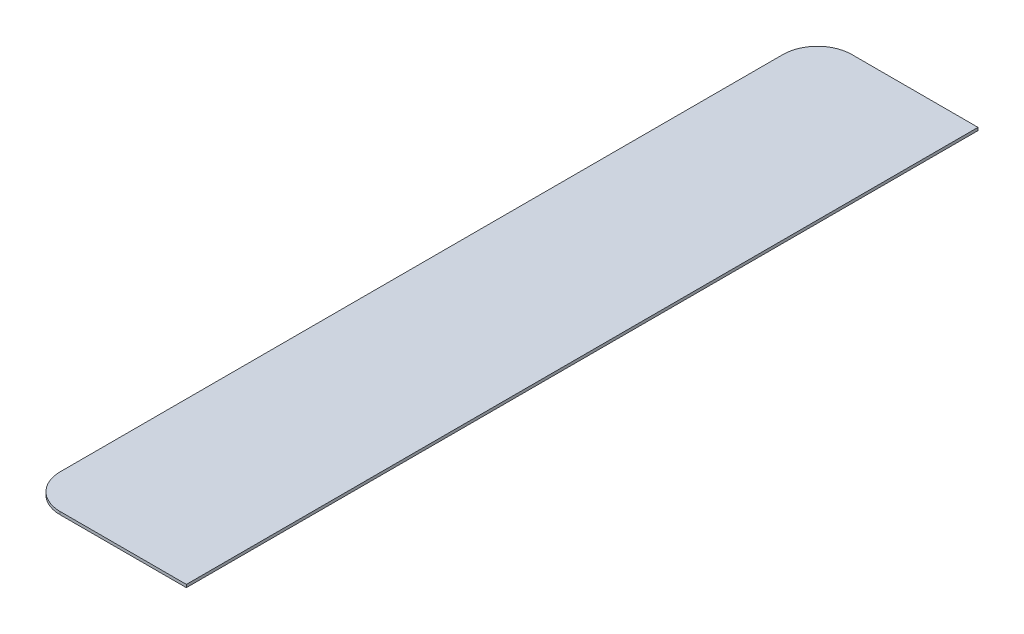
ISO-10303-21;
HEADER;
FILE_DESCRIPTION(('STEP AP214'),'2;1');
FILE_NAME('part.step','',(''),(''),'','','');
FILE_SCHEMA(('AUTOMOTIVE_DESIGN { 1 0 10303 214 1 1 1 1 }'));
ENDSEC;
DATA;
#1=APPLICATION_CONTEXT('core data for automotive mechanical design processes');
#2=APPLICATION_PROTOCOL_DEFINITION('international standard','automotive_design',2000,#1);
#3=PRODUCT_CONTEXT('',#1,'mechanical');
#4=PRODUCT('Part','Part','',(#3));
#5=PRODUCT_RELATED_PRODUCT_CATEGORY('part','',(#4));
#6=PRODUCT_DEFINITION_FORMATION('','',#4);
#7=PRODUCT_DEFINITION_CONTEXT('part definition',#1,'design');
#8=PRODUCT_DEFINITION('design','',#6,#7);
#9=PRODUCT_DEFINITION_SHAPE('','',#8);
#10=(LENGTH_UNIT() NAMED_UNIT(*) SI_UNIT(.MILLI.,.METRE.));
#11=(NAMED_UNIT(*) PLANE_ANGLE_UNIT() SI_UNIT($,.RADIAN.));
#12=(NAMED_UNIT(*) SI_UNIT($,.STERADIAN.) SOLID_ANGLE_UNIT());
#13=UNCERTAINTY_MEASURE_WITH_UNIT(LENGTH_MEASURE(1.E-05),#10,'distance_accuracy_value','');
#14=(GEOMETRIC_REPRESENTATION_CONTEXT(3) GLOBAL_UNCERTAINTY_ASSIGNED_CONTEXT((#13)) GLOBAL_UNIT_ASSIGNED_CONTEXT((#10,
#11,#12)) REPRESENTATION_CONTEXT('',''));
#15=CARTESIAN_POINT('',(0.,0.,0.));
#16=DIRECTION('',(0.,0.,1.));
#17=DIRECTION('',(1.,0.,0.));
#18=AXIS2_PLACEMENT_3D('',#15,#16,#17);
#19=CARTESIAN_POINT('',(0.,6.35,0.));
#20=DIRECTION('',(-1.,0.,0.));
#21=DIRECTION('',(0.,0.,1.));
#22=AXIS2_PLACEMENT_3D('',#19,#20,#21);
#23=PLANE('',#22);
#24=DIRECTION('',(0.,0.,-1.));
#25=VECTOR('',#24,1.);
#26=CARTESIAN_POINT('',(0.,0.,0.));
#27=LINE('',#26,#25);
#28=CARTESIAN_POINT('',(2.14631598018565E-13,0.,1752.6));
#29=VERTEX_POINT('',#28);
#30=CARTESIAN_POINT('',(0.,0.,0.));
#31=VERTEX_POINT('',#30);
#32=EDGE_CURVE('E116',#29,#31,#27,.T.);
#33=ORIENTED_EDGE('',*,*,#32,.T.);
#34=DIRECTION('',(0.,-1.,0.));
#35=VECTOR('',#34,1.);
#36=CARTESIAN_POINT('',(0.,6.35,0.));
#37=LINE('',#36,#35);
#38=CARTESIAN_POINT('',(0.,6.35,0.));
#39=VERTEX_POINT('',#38);
#40=EDGE_CURVE('E11',#39,#31,#37,.T.);
#41=ORIENTED_EDGE('',*,*,#40,.F.);
#42=DIRECTION('',(0.,0.,-1.));
#43=VECTOR('',#42,1.);
#44=CARTESIAN_POINT('',(0.,6.35,0.));
#45=LINE('',#44,#43);
#46=CARTESIAN_POINT('',(2.14631598018565E-13,6.35,1752.6));
#47=VERTEX_POINT('',#46);
#48=EDGE_CURVE('E126',#47,#39,#45,.T.);
#49=ORIENTED_EDGE('',*,*,#48,.F.);
#50=DIRECTION('',(0.,-1.,0.));
#51=VECTOR('',#50,1.);
#52=CARTESIAN_POINT('',(2.14631598018565E-13,6.35,1752.6));
#53=LINE('',#52,#51);
#54=EDGE_CURVE('E112',#47,#29,#53,.T.);
#55=ORIENTED_EDGE('',*,*,#54,.T.);
#56=EDGE_LOOP('',(#33,#41,#49,#55));
#57=FACE_BOUND('',#56,.T.);
#58=ADVANCED_FACE('F32',(#57),#23,.F.);
#59=CARTESIAN_POINT('',(0.,6.35,0.));
#60=DIRECTION('',(0.,0.,1.));
#61=DIRECTION('',(1.,0.,0.));
#62=AXIS2_PLACEMENT_3D('',#59,#60,#61);
#63=PLANE('',#62);
#64=DIRECTION('',(-1.,0.,0.));
#65=VECTOR('',#64,1.);
#66=CARTESIAN_POINT('',(0.,0.,0.));
#67=LINE('',#66,#65);
#68=CARTESIAN_POINT('',(-279.399999999999,0.,0.));
#69=VERTEX_POINT('',#68);
#70=EDGE_CURVE('E119',#31,#69,#67,.T.);
#71=ORIENTED_EDGE('',*,*,#70,.T.);
#72=DIRECTION('',(0.,-1.,0.));
#73=VECTOR('',#72,1.);
#74=CARTESIAN_POINT('',(-279.399999999999,6.35,0.));
#75=LINE('',#74,#73);
#76=CARTESIAN_POINT('',(-279.399999999999,6.35,0.));
#77=VERTEX_POINT('',#76);
#78=EDGE_CURVE('E40',#77,#69,#75,.T.);
#79=ORIENTED_EDGE('',*,*,#78,.F.);
#80=DIRECTION('',(-1.,0.,0.));
#81=VECTOR('',#80,1.);
#82=CARTESIAN_POINT('',(0.,6.35,0.));
#83=LINE('',#82,#81);
#84=EDGE_CURVE('E85',#39,#77,#83,.T.);
#85=ORIENTED_EDGE('',*,*,#84,.F.);
#86=ORIENTED_EDGE('',*,*,#40,.T.);
#87=EDGE_LOOP('',(#71,#79,#85,#86));
#88=FACE_BOUND('',#87,.T.);
#89=ADVANCED_FACE('F150',(#88),#63,.F.);
#90=CARTESIAN_POINT('',(-279.4,6.35,76.2));
#91=DIRECTION('',(0.,-1.,0.));
#92=DIRECTION('',(0.,0.,-1.));
#93=AXIS2_PLACEMENT_3D('',#90,#91,#92);
#94=CYLINDRICAL_SURFACE('',#93,76.2);
#95=CARTESIAN_POINT('',(-279.4,0.,76.2));
#96=DIRECTION('',(0.,1.,0.));
#97=DIRECTION('',(0.,0.,-1.));
#98=AXIS2_PLACEMENT_3D('',#95,#96,#97);
#99=CIRCLE('',#98,76.2);
#100=CARTESIAN_POINT('',(-355.6,0.,76.2000000000006));
#101=VERTEX_POINT('',#100);
#102=EDGE_CURVE('E121',#69,#101,#99,.T.);
#103=ORIENTED_EDGE('',*,*,#102,.T.);
#104=DIRECTION('',(0.,-1.,0.));
#105=VECTOR('',#104,1.);
#106=CARTESIAN_POINT('',(-355.6,6.35,76.2000000000006));
#107=LINE('',#106,#105);
#108=CARTESIAN_POINT('',(-355.6,6.35,76.2000000000006));
#109=VERTEX_POINT('',#108);
#110=EDGE_CURVE('E107',#109,#101,#107,.T.);
#111=ORIENTED_EDGE('',*,*,#110,.F.);
#112=CARTESIAN_POINT('',(-279.4,6.35,76.2));
#113=DIRECTION('',(0.,1.,0.));
#114=DIRECTION('',(0.,0.,-1.));
#115=AXIS2_PLACEMENT_3D('',#112,#113,#114);
#116=CIRCLE('',#115,76.2);
#117=EDGE_CURVE('E98',#77,#109,#116,.T.);
#118=ORIENTED_EDGE('',*,*,#117,.F.);
#119=ORIENTED_EDGE('',*,*,#78,.T.);
#120=EDGE_LOOP('',(#103,#111,#118,#119));
#121=FACE_BOUND('',#120,.T.);
#122=ADVANCED_FACE('F132',(#121),#94,.T.);
#123=CARTESIAN_POINT('',(-355.6,6.35,76.2000000000006));
#124=DIRECTION('',(1.,0.,0.));
#125=DIRECTION('',(0.,0.,-1.));
#126=AXIS2_PLACEMENT_3D('',#123,#124,#125);
#127=PLANE('',#126);
#128=DIRECTION('',(0.,0.,1.));
#129=VECTOR('',#128,1.);
#130=CARTESIAN_POINT('',(-355.6,0.,76.2000000000006));
#131=LINE('',#130,#129);
#132=CARTESIAN_POINT('',(-355.6,0.,1676.4));
#133=VERTEX_POINT('',#132);
#134=EDGE_CURVE('E106',#101,#133,#131,.T.);
#135=ORIENTED_EDGE('',*,*,#134,.T.);
#136=DIRECTION('',(0.,-1.,0.));
#137=VECTOR('',#136,1.);
#138=CARTESIAN_POINT('',(-355.6,6.35,1676.4));
#139=LINE('',#138,#137);
#140=CARTESIAN_POINT('',(-355.6,6.35,1676.4));
#141=VERTEX_POINT('',#140);
#142=EDGE_CURVE('E103',#141,#133,#139,.T.);
#143=ORIENTED_EDGE('',*,*,#142,.F.);
#144=DIRECTION('',(0.,0.,1.));
#145=VECTOR('',#144,1.);
#146=CARTESIAN_POINT('',(-355.6,6.35,76.2000000000006));
#147=LINE('',#146,#145);
#148=EDGE_CURVE('E92',#109,#141,#147,.T.);
#149=ORIENTED_EDGE('',*,*,#148,.F.);
#150=ORIENTED_EDGE('',*,*,#110,.T.);
#151=EDGE_LOOP('',(#135,#143,#149,#150));
#152=FACE_BOUND('',#151,.T.);
#153=ADVANCED_FACE('F104',(#152),#127,.F.);
#154=CARTESIAN_POINT('',(-279.4,6.35,1676.4));
#155=DIRECTION('',(0.,-1.,0.));
#156=DIRECTION('',(0.,0.,-1.));
#157=AXIS2_PLACEMENT_3D('',#154,#155,#156);
#158=CYLINDRICAL_SURFACE('',#157,76.2);
#159=CARTESIAN_POINT('',(-279.4,0.,1676.4));
#160=DIRECTION('',(0.,1.,0.));
#161=DIRECTION('',(0.,0.,1.));
#162=AXIS2_PLACEMENT_3D('',#159,#160,#161);
#163=CIRCLE('',#162,76.2);
#164=CARTESIAN_POINT('',(-279.4,0.,1752.6));
#165=VERTEX_POINT('',#164);
#166=EDGE_CURVE('E71',#133,#165,#163,.T.);
#167=ORIENTED_EDGE('',*,*,#166,.T.);
#168=DIRECTION('',(0.,-1.,0.));
#169=VECTOR('',#168,1.);
#170=CARTESIAN_POINT('',(-279.4,6.35,1752.6));
#171=LINE('',#170,#169);
#172=CARTESIAN_POINT('',(-279.4,6.35,1752.6));
#173=VERTEX_POINT('',#172);
#174=EDGE_CURVE('E108',#173,#165,#171,.T.);
#175=ORIENTED_EDGE('',*,*,#174,.F.);
#176=CARTESIAN_POINT('',(-279.4,6.35,1676.4));
#177=DIRECTION('',(0.,1.,0.));
#178=DIRECTION('',(0.,0.,1.));
#179=AXIS2_PLACEMENT_3D('',#176,#177,#178);
#180=CIRCLE('',#179,76.2);
#181=EDGE_CURVE('E96',#141,#173,#180,.T.);
#182=ORIENTED_EDGE('',*,*,#181,.F.);
#183=ORIENTED_EDGE('',*,*,#142,.T.);
#184=EDGE_LOOP('',(#167,#175,#182,#183));
#185=FACE_BOUND('',#184,.T.);
#186=ADVANCED_FACE('F110',(#185),#158,.T.);
#187=CARTESIAN_POINT('',(2.14631598018565E-13,6.35,1752.6));
#188=DIRECTION('',(0.,0.,-1.));
#189=DIRECTION('',(-1.,0.,0.));
#190=AXIS2_PLACEMENT_3D('',#187,#188,#189);
#191=PLANE('',#190);
#192=DIRECTION('',(1.,0.,0.));
#193=VECTOR('',#192,1.);
#194=CARTESIAN_POINT('',(2.14631598018565E-13,0.,1752.6));
#195=LINE('',#194,#193);
#196=EDGE_CURVE('E77',#165,#29,#195,.T.);
#197=ORIENTED_EDGE('',*,*,#196,.T.);
#198=ORIENTED_EDGE('',*,*,#54,.F.);
#199=DIRECTION('',(1.,0.,0.));
#200=VECTOR('',#199,1.);
#201=CARTESIAN_POINT('',(2.14631598018565E-13,6.35,1752.6));
#202=LINE('',#201,#200);
#203=EDGE_CURVE('E48',#173,#47,#202,.T.);
#204=ORIENTED_EDGE('',*,*,#203,.F.);
#205=ORIENTED_EDGE('',*,*,#174,.T.);
#206=EDGE_LOOP('',(#197,#198,#204,#205));
#207=FACE_BOUND('',#206,.T.);
#208=ADVANCED_FACE('F139',(#207),#191,.F.);
#209=CARTESIAN_POINT('',(-279.4,6.35,1676.4));
#210=DIRECTION('',(0.,1.,0.));
#211=DIRECTION('',(0.,0.,1.));
#212=AXIS2_PLACEMENT_3D('',#209,#210,#211);
#213=PLANE('',#212);
#214=ORIENTED_EDGE('',*,*,#48,.T.);
#215=ORIENTED_EDGE('',*,*,#84,.T.);
#216=ORIENTED_EDGE('',*,*,#117,.T.);
#217=ORIENTED_EDGE('',*,*,#148,.T.);
#218=ORIENTED_EDGE('',*,*,#181,.T.);
#219=ORIENTED_EDGE('',*,*,#203,.T.);
#220=EDGE_LOOP('',(#214,#215,#216,#217,#218,#219));
#221=FACE_BOUND('',#220,.T.);
#222=ADVANCED_FACE('F94',(#221),#213,.T.);
#223=CARTESIAN_POINT('',(-279.4,0.,1676.4));
#224=DIRECTION('',(0.,1.,0.));
#225=DIRECTION('',(0.,0.,1.));
#226=AXIS2_PLACEMENT_3D('',#223,#224,#225);
#227=PLANE('',#226);
#228=ORIENTED_EDGE('',*,*,#32,.F.);
#229=ORIENTED_EDGE('',*,*,#196,.F.);
#230=ORIENTED_EDGE('',*,*,#166,.F.);
#231=ORIENTED_EDGE('',*,*,#134,.F.);
#232=ORIENTED_EDGE('',*,*,#102,.F.);
#233=ORIENTED_EDGE('',*,*,#70,.F.);
#234=EDGE_LOOP('',(#228,#229,#230,#231,#232,#233));
#235=FACE_BOUND('',#234,.T.);
#236=ADVANCED_FACE('F135',(#235),#227,.F.);
#237=CLOSED_SHELL('',(#58,#89,#122,#153,#186,#208,#222,#236));
#238=MANIFOLD_SOLID_BREP('B2',#237);
#239=ADVANCED_BREP_SHAPE_REPRESENTATION('',(#18,#238),#14);
#240=SHAPE_DEFINITION_REPRESENTATION(#9,#239);
ENDSEC;
END-ISO-10303-21;
